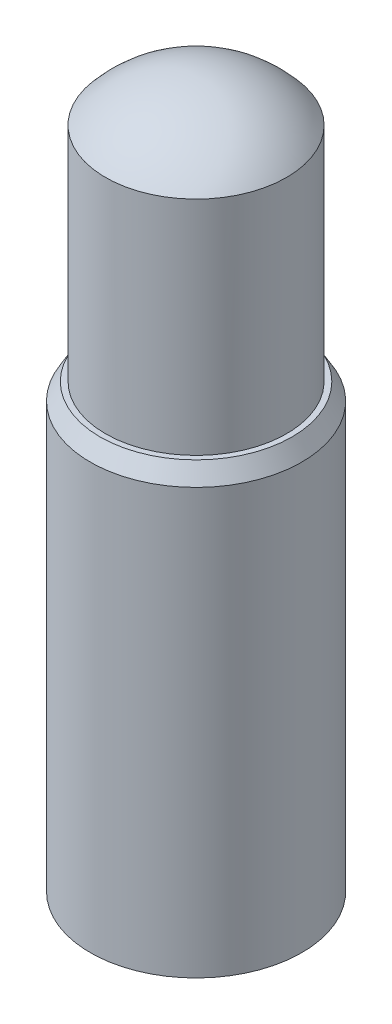
ISO-10303-21;
HEADER;
FILE_DESCRIPTION(('STEP AP214'),'2;1');
FILE_NAME('part.step','',(''),(''),'','','');
FILE_SCHEMA(('AUTOMOTIVE_DESIGN { 1 0 10303 214 1 1 1 1 }'));
ENDSEC;
DATA;
#1=APPLICATION_CONTEXT('core data for automotive mechanical design processes');
#2=APPLICATION_PROTOCOL_DEFINITION('international standard','automotive_design',2000,#1);
#3=PRODUCT_CONTEXT('',#1,'mechanical');
#4=PRODUCT('Part','Part','',(#3));
#5=PRODUCT_RELATED_PRODUCT_CATEGORY('part','',(#4));
#6=PRODUCT_DEFINITION_FORMATION('','',#4);
#7=PRODUCT_DEFINITION_CONTEXT('part definition',#1,'design');
#8=PRODUCT_DEFINITION('design','',#6,#7);
#9=PRODUCT_DEFINITION_SHAPE('','',#8);
#10=(LENGTH_UNIT() NAMED_UNIT(*) SI_UNIT(.MILLI.,.METRE.));
#11=(NAMED_UNIT(*) PLANE_ANGLE_UNIT() SI_UNIT($,.RADIAN.));
#12=(NAMED_UNIT(*) SI_UNIT($,.STERADIAN.) SOLID_ANGLE_UNIT());
#13=UNCERTAINTY_MEASURE_WITH_UNIT(LENGTH_MEASURE(1.E-05),#10,'distance_accuracy_value','');
#14=(GEOMETRIC_REPRESENTATION_CONTEXT(3) GLOBAL_UNCERTAINTY_ASSIGNED_CONTEXT((#13)) GLOBAL_UNIT_ASSIGNED_CONTEXT((#10,
#11,#12)) REPRESENTATION_CONTEXT('',''));
#15=CARTESIAN_POINT('',(0.,0.,0.));
#16=DIRECTION('',(0.,0.,1.));
#17=DIRECTION('',(1.,0.,0.));
#18=AXIS2_PLACEMENT_3D('',#15,#16,#17);
#19=CARTESIAN_POINT('',(-5.815,4.04,0.));
#20=DIRECTION('',(0.,-1.,0.));
#21=DIRECTION('',(0.,0.,-1.));
#22=AXIS2_PLACEMENT_3D('',#19,#20,#21);
#23=PLANE('',#22);
#24=CARTESIAN_POINT('',(-6.35,4.04,0.));
#25=DIRECTION('',(0.,-1.,0.));
#26=DIRECTION('',(0.,0.,-1.));
#27=AXIS2_PLACEMENT_3D('',#24,#25,#26);
#28=CIRCLE('',#27,0.567264973081037);
#29=CARTESIAN_POINT('',(-6.35,4.04,-0.567264973081037));
#30=VERTEX_POINT('',#29);
#31=EDGE_CURVE('E41',#30,#30,#28,.T.);
#32=ORIENTED_EDGE('',*,*,#31,.F.);
#33=EDGE_LOOP('',(#32));
#34=FACE_BOUND('',#33,.T.);
#35=CARTESIAN_POINT('',(-6.35,4.04,0.));
#36=DIRECTION('',(0.,-1.,0.));
#37=DIRECTION('',(0.,0.,-1.));
#38=AXIS2_PLACEMENT_3D('',#35,#36,#37);
#39=CIRCLE('',#38,0.535);
#40=CARTESIAN_POINT('',(-6.35,4.04,-0.535));
#41=VERTEX_POINT('',#40);
#42=EDGE_CURVE('E10',#41,#41,#39,.T.);
#43=ORIENTED_EDGE('',*,*,#42,.T.);
#44=EDGE_LOOP('',(#43));
#45=FACE_BOUND('',#44,.T.);
#46=ADVANCED_FACE('F14',(#34,#45),#23,.F.);
#47=CARTESIAN_POINT('',(-6.35,5.6,0.));
#48=DIRECTION('',(0.,-1.,0.));
#49=DIRECTION('',(0.,0.,-1.));
#50=AXIS2_PLACEMENT_3D('',#47,#48,#49);
#51=CYLINDRICAL_SURFACE('',#50,0.535);
#52=ORIENTED_EDGE('',*,*,#42,.F.);
#53=EDGE_LOOP('',(#52));
#54=FACE_BOUND('',#53,.T.);
#55=CARTESIAN_POINT('',(-6.35,5.35141444372107,0.));
#56=DIRECTION('',(0.,-1.,0.));
#57=DIRECTION('',(0.,0.,-1.));
#58=AXIS2_PLACEMENT_3D('',#55,#56,#57);
#59=CIRCLE('',#58,0.535);
#60=CARTESIAN_POINT('',(-6.35,5.35141444372107,-0.535));
#61=VERTEX_POINT('',#60);
#62=EDGE_CURVE('E21',#61,#61,#59,.T.);
#63=ORIENTED_EDGE('',*,*,#62,.T.);
#64=EDGE_LOOP('',(#63));
#65=FACE_BOUND('',#64,.T.);
#66=ADVANCED_FACE('F50',(#54,#65),#51,.T.);
#67=CARTESIAN_POINT('',(-6.35,4.9,0.));
#68=DIRECTION('',(0.,-1.,0.));
#69=DIRECTION('',(1.,0.,0.));
#70=AXIS2_PLACEMENT_3D('',#67,#68,#69);
#71=SPHERICAL_SURFACE('',#70,0.7);
#72=ORIENTED_EDGE('',*,*,#62,.F.);
#73=EDGE_LOOP('',(#72));
#74=FACE_BOUND('',#73,.T.);
#75=ADVANCED_FACE('F55',(#74),#71,.T.);
#76=CARTESIAN_POINT('',(-5.725,1.43,0.));
#77=DIRECTION('',(0.,1.,0.));
#78=DIRECTION('',(0.,0.,1.));
#79=AXIS2_PLACEMENT_3D('',#76,#77,#78);
#80=PLANE('',#79);
#81=CARTESIAN_POINT('',(-6.35,1.43,0.));
#82=DIRECTION('',(0.,-1.,0.));
#83=DIRECTION('',(0.,0.,-1.));
#84=AXIS2_PLACEMENT_3D('',#81,#82,#83);
#85=CIRCLE('',#84,0.625);
#86=CARTESIAN_POINT('',(-6.35,1.43,-0.625));
#87=VERTEX_POINT('',#86);
#88=EDGE_CURVE('E29',#87,#87,#85,.T.);
#89=ORIENTED_EDGE('',*,*,#88,.T.);
#90=EDGE_LOOP('',(#89));
#91=FACE_BOUND('',#90,.T.);
#92=ADVANCED_FACE('F60',(#91),#80,.F.);
#93=CARTESIAN_POINT('',(-6.35,5.6,0.));
#94=DIRECTION('',(0.,-1.,0.));
#95=DIRECTION('',(0.,0.,-1.));
#96=AXIS2_PLACEMENT_3D('',#93,#94,#95);
#97=CYLINDRICAL_SURFACE('',#96,0.625);
#98=ORIENTED_EDGE('',*,*,#88,.F.);
#99=EDGE_LOOP('',(#98));
#100=FACE_BOUND('',#99,.T.);
#101=CARTESIAN_POINT('',(-6.35,3.94,0.));
#102=DIRECTION('',(0.,-1.,0.));
#103=DIRECTION('',(0.,0.,-1.));
#104=AXIS2_PLACEMENT_3D('',#101,#102,#103);
#105=CIRCLE('',#104,0.625);
#106=CARTESIAN_POINT('',(-6.35,3.94,-0.625));
#107=VERTEX_POINT('',#106);
#108=EDGE_CURVE('E35',#107,#107,#105,.T.);
#109=ORIENTED_EDGE('',*,*,#108,.T.);
#110=EDGE_LOOP('',(#109));
#111=FACE_BOUND('',#110,.T.);
#112=ADVANCED_FACE('F66',(#100,#111),#97,.T.);
#113=CARTESIAN_POINT('',(-6.35,4.04,0.));
#114=DIRECTION('',(0.,-1.,0.));
#115=DIRECTION('',(0.,0.,-1.));
#116=AXIS2_PLACEMENT_3D('',#113,#114,#115);
#117=CONICAL_SURFACE('',#116,0.567264973081037,0.523598775598299);
#118=ORIENTED_EDGE('',*,*,#108,.F.);
#119=EDGE_LOOP('',(#118));
#120=FACE_BOUND('',#119,.T.);
#121=ORIENTED_EDGE('',*,*,#31,.T.);
#122=EDGE_LOOP('',(#121));
#123=FACE_BOUND('',#122,.T.);
#124=ADVANCED_FACE('F47',(#120,#123),#117,.T.);
#125=CLOSED_SHELL('',(#46,#66,#75,#92,#112,#124));
#126=MANIFOLD_SOLID_BREP('B1',#125);
#127=ADVANCED_BREP_SHAPE_REPRESENTATION('',(#18,#126),#14);
#128=SHAPE_DEFINITION_REPRESENTATION(#9,#127);
ENDSEC;
END-ISO-10303-21;
